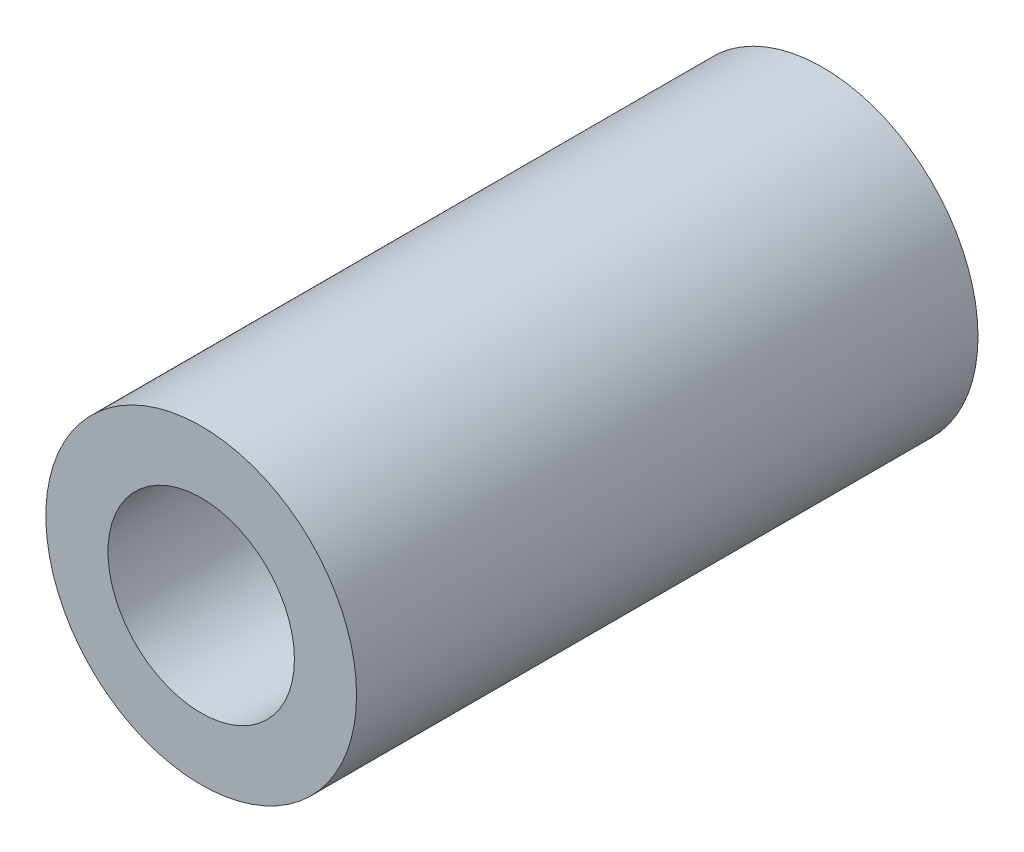
ISO-10303-21;
HEADER;
FILE_DESCRIPTION(('STEP AP214'),'2;1');
FILE_NAME('part.step','',(''),(''),'','','');
FILE_SCHEMA(('AUTOMOTIVE_DESIGN { 1 0 10303 214 1 1 1 1 }'));
ENDSEC;
DATA;
#1=APPLICATION_CONTEXT('core data for automotive mechanical design processes');
#2=APPLICATION_PROTOCOL_DEFINITION('international standard','automotive_design',2000,#1);
#3=PRODUCT_CONTEXT('',#1,'mechanical');
#4=PRODUCT('Part','Part','',(#3));
#5=PRODUCT_RELATED_PRODUCT_CATEGORY('part','',(#4));
#6=PRODUCT_DEFINITION_FORMATION('','',#4);
#7=PRODUCT_DEFINITION_CONTEXT('part definition',#1,'design');
#8=PRODUCT_DEFINITION('design','',#6,#7);
#9=PRODUCT_DEFINITION_SHAPE('','',#8);
#10=(LENGTH_UNIT() NAMED_UNIT(*) SI_UNIT(.MILLI.,.METRE.));
#11=(NAMED_UNIT(*) PLANE_ANGLE_UNIT() SI_UNIT($,.RADIAN.));
#12=(NAMED_UNIT(*) SI_UNIT($,.STERADIAN.) SOLID_ANGLE_UNIT());
#13=UNCERTAINTY_MEASURE_WITH_UNIT(LENGTH_MEASURE(1.E-05),#10,'distance_accuracy_value','');
#14=(GEOMETRIC_REPRESENTATION_CONTEXT(3) GLOBAL_UNCERTAINTY_ASSIGNED_CONTEXT((#13)) GLOBAL_UNIT_ASSIGNED_CONTEXT((#10,
#11,#12)) REPRESENTATION_CONTEXT('',''));
#15=CARTESIAN_POINT('',(0.,0.,0.));
#16=DIRECTION('',(0.,0.,1.));
#17=DIRECTION('',(1.,0.,0.));
#18=AXIS2_PLACEMENT_3D('',#15,#16,#17);
#19=CARTESIAN_POINT('',(0.,0.,10.));
#20=DIRECTION('',(0.,0.,-1.));
#21=DIRECTION('',(-1.,0.,0.));
#22=AXIS2_PLACEMENT_3D('',#19,#20,#21);
#23=CYLINDRICAL_SURFACE('',#22,2.5);
#24=CARTESIAN_POINT('',(0.,0.,10.));
#25=DIRECTION('',(0.,0.,1.));
#26=DIRECTION('',(1.,0.,0.));
#27=AXIS2_PLACEMENT_3D('',#24,#25,#26);
#28=CIRCLE('',#27,2.5);
#29=CARTESIAN_POINT('',(2.5,0.,10.));
#30=VERTEX_POINT('',#29);
#31=EDGE_CURVE('E10',#30,#30,#28,.T.);
#32=ORIENTED_EDGE('',*,*,#31,.F.);
#33=EDGE_LOOP('',(#32));
#34=FACE_BOUND('',#33,.T.);
#35=CARTESIAN_POINT('',(0.,0.,0.));
#36=DIRECTION('',(0.,0.,1.));
#37=DIRECTION('',(1.,0.,0.));
#38=AXIS2_PLACEMENT_3D('',#35,#36,#37);
#39=CIRCLE('',#38,2.5);
#40=CARTESIAN_POINT('',(2.5,0.,0.));
#41=VERTEX_POINT('',#40);
#42=EDGE_CURVE('E34',#41,#41,#39,.T.);
#43=ORIENTED_EDGE('',*,*,#42,.T.);
#44=EDGE_LOOP('',(#43));
#45=FACE_BOUND('',#44,.T.);
#46=ADVANCED_FACE('F31',(#34,#45),#23,.T.);
#47=CARTESIAN_POINT('',(0.,0.,10.));
#48=DIRECTION('',(0.,0.,1.));
#49=DIRECTION('',(1.,0.,0.));
#50=AXIS2_PLACEMENT_3D('',#47,#48,#49);
#51=PLANE('',#50);
#52=CARTESIAN_POINT('',(0.,0.,10.));
#53=DIRECTION('',(0.,0.,1.));
#54=DIRECTION('',(1.,0.,0.));
#55=AXIS2_PLACEMENT_3D('',#52,#53,#54);
#56=CIRCLE('',#55,1.5);
#57=CARTESIAN_POINT('',(1.5,0.,10.));
#58=VERTEX_POINT('',#57);
#59=EDGE_CURVE('E43',#58,#58,#56,.T.);
#60=ORIENTED_EDGE('',*,*,#59,.F.);
#61=EDGE_LOOP('',(#60));
#62=FACE_BOUND('',#61,.T.);
#63=ORIENTED_EDGE('',*,*,#31,.T.);
#64=EDGE_LOOP('',(#63));
#65=FACE_BOUND('',#64,.T.);
#66=ADVANCED_FACE('F58',(#62,#65),#51,.T.);
#67=CARTESIAN_POINT('',(0.,0.,0.));
#68=DIRECTION('',(0.,0.,1.));
#69=DIRECTION('',(1.,0.,0.));
#70=AXIS2_PLACEMENT_3D('',#67,#68,#69);
#71=PLANE('',#70);
#72=CARTESIAN_POINT('',(0.,0.,0.));
#73=DIRECTION('',(0.,0.,1.));
#74=DIRECTION('',(1.,0.,0.));
#75=AXIS2_PLACEMENT_3D('',#72,#73,#74);
#76=CIRCLE('',#75,1.5);
#77=CARTESIAN_POINT('',(1.5,0.,0.));
#78=VERTEX_POINT('',#77);
#79=EDGE_CURVE('E41',#78,#78,#76,.T.);
#80=ORIENTED_EDGE('',*,*,#79,.T.);
#81=EDGE_LOOP('',(#80));
#82=FACE_BOUND('',#81,.T.);
#83=ORIENTED_EDGE('',*,*,#42,.F.);
#84=EDGE_LOOP('',(#83));
#85=FACE_BOUND('',#84,.T.);
#86=ADVANCED_FACE('F49',(#82,#85),#71,.F.);
#87=CARTESIAN_POINT('',(0.,0.,0.));
#88=DIRECTION('',(0.,0.,1.));
#89=DIRECTION('',(1.,0.,0.));
#90=AXIS2_PLACEMENT_3D('',#87,#88,#89);
#91=CYLINDRICAL_SURFACE('',#90,1.5);
#92=ORIENTED_EDGE('',*,*,#79,.F.);
#93=EDGE_LOOP('',(#92));
#94=FACE_BOUND('',#93,.T.);
#95=ORIENTED_EDGE('',*,*,#59,.T.);
#96=EDGE_LOOP('',(#95));
#97=FACE_BOUND('',#96,.T.);
#98=ADVANCED_FACE('F52',(#94,#97),#91,.F.);
#99=CLOSED_SHELL('',(#46,#66,#86,#98));
#100=MANIFOLD_SOLID_BREP('B2',#99);
#101=ADVANCED_BREP_SHAPE_REPRESENTATION('',(#18,#100),#14);
#102=SHAPE_DEFINITION_REPRESENTATION(#9,#101);
ENDSEC;
END-ISO-10303-21;
